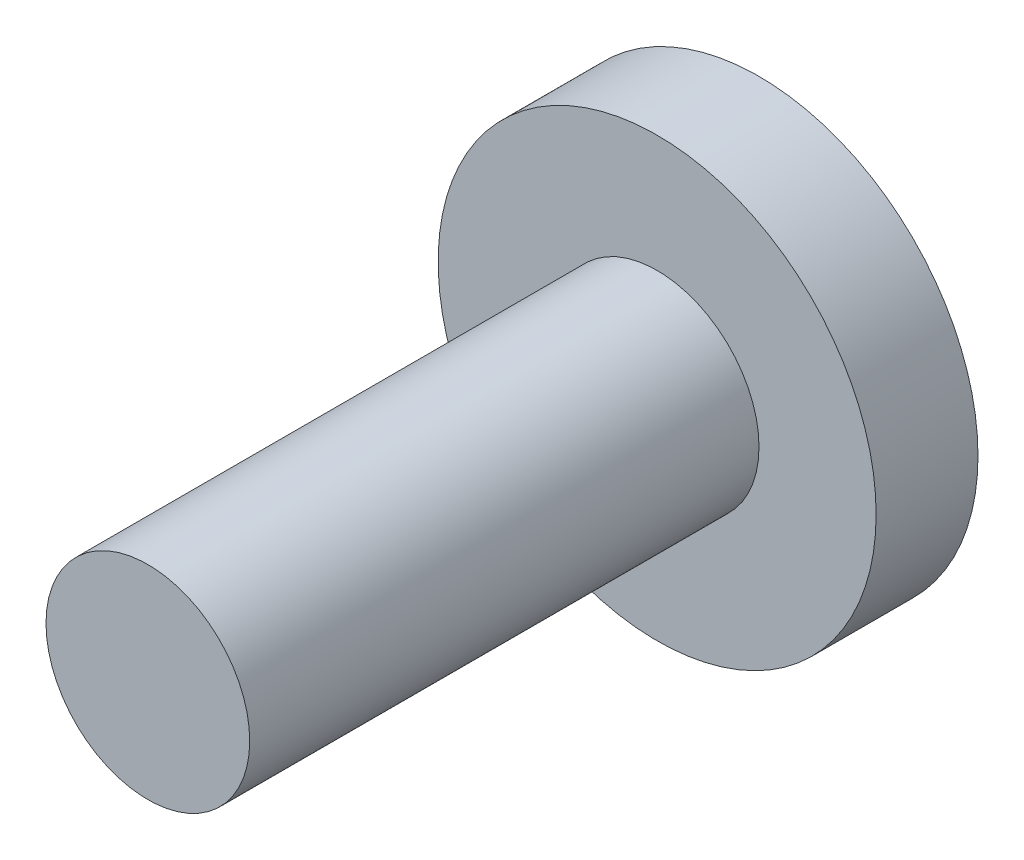
ISO-10303-21;
HEADER;
FILE_DESCRIPTION(('STEP AP214'),'2;1');
FILE_NAME('part.step','',(''),(''),'','','');
FILE_SCHEMA(('AUTOMOTIVE_DESIGN { 1 0 10303 214 1 1 1 1 }'));
ENDSEC;
DATA;
#1=APPLICATION_CONTEXT('core data for automotive mechanical design processes');
#2=APPLICATION_PROTOCOL_DEFINITION('international standard','automotive_design',2000,#1);
#3=PRODUCT_CONTEXT('',#1,'mechanical');
#4=PRODUCT('Part','Part','',(#3));
#5=PRODUCT_RELATED_PRODUCT_CATEGORY('part','',(#4));
#6=PRODUCT_DEFINITION_FORMATION('','',#4);
#7=PRODUCT_DEFINITION_CONTEXT('part definition',#1,'design');
#8=PRODUCT_DEFINITION('design','',#6,#7);
#9=PRODUCT_DEFINITION_SHAPE('','',#8);
#10=(LENGTH_UNIT() NAMED_UNIT(*) SI_UNIT(.MILLI.,.METRE.));
#11=(NAMED_UNIT(*) PLANE_ANGLE_UNIT() SI_UNIT($,.RADIAN.));
#12=(NAMED_UNIT(*) SI_UNIT($,.STERADIAN.) SOLID_ANGLE_UNIT());
#13=UNCERTAINTY_MEASURE_WITH_UNIT(LENGTH_MEASURE(1.E-05),#10,'distance_accuracy_value','');
#14=(GEOMETRIC_REPRESENTATION_CONTEXT(3) GLOBAL_UNCERTAINTY_ASSIGNED_CONTEXT((#13)) GLOBAL_UNIT_ASSIGNED_CONTEXT((#10,
#11,#12)) REPRESENTATION_CONTEXT('',''));
#15=CARTESIAN_POINT('',(0.,0.,0.));
#16=DIRECTION('',(0.,0.,1.));
#17=DIRECTION('',(1.,0.,0.));
#18=AXIS2_PLACEMENT_3D('',#15,#16,#17);
#19=CARTESIAN_POINT('',(33.2,15.9,1.));
#20=DIRECTION('',(0.,0.,-1.));
#21=DIRECTION('',(-1.,0.,0.));
#22=AXIS2_PLACEMENT_3D('',#19,#20,#21);
#23=CYLINDRICAL_SURFACE('',#22,2.14999999999999);
#24=CARTESIAN_POINT('',(33.2,15.9,1.));
#25=DIRECTION('',(0.,0.,1.));
#26=DIRECTION('',(1.,0.,0.));
#27=AXIS2_PLACEMENT_3D('',#24,#25,#26);
#28=CIRCLE('',#27,2.14999999999999);
#29=CARTESIAN_POINT('',(35.35,15.9,1.));
#30=VERTEX_POINT('',#29);
#31=EDGE_CURVE('E10',#30,#30,#28,.T.);
#32=ORIENTED_EDGE('',*,*,#31,.F.);
#33=EDGE_LOOP('',(#32));
#34=FACE_BOUND('',#33,.T.);
#35=CARTESIAN_POINT('',(33.2,15.9,0.));
#36=DIRECTION('',(0.,0.,1.));
#37=DIRECTION('',(1.,0.,0.));
#38=AXIS2_PLACEMENT_3D('',#35,#36,#37);
#39=CIRCLE('',#38,2.14999999999999);
#40=CARTESIAN_POINT('',(35.35,15.9,0.));
#41=VERTEX_POINT('',#40);
#42=EDGE_CURVE('E33',#41,#41,#39,.T.);
#43=ORIENTED_EDGE('',*,*,#42,.T.);
#44=EDGE_LOOP('',(#43));
#45=FACE_BOUND('',#44,.T.);
#46=ADVANCED_FACE('F30',(#34,#45),#23,.T.);
#47=CARTESIAN_POINT('',(33.2,15.9,1.));
#48=DIRECTION('',(0.,0.,1.));
#49=DIRECTION('',(1.,0.,0.));
#50=AXIS2_PLACEMENT_3D('',#47,#48,#49);
#51=PLANE('',#50);
#52=CARTESIAN_POINT('',(33.2,15.9,1.));
#53=DIRECTION('',(0.,0.,1.));
#54=DIRECTION('',(1.,0.,0.));
#55=AXIS2_PLACEMENT_3D('',#52,#53,#54);
#56=CIRCLE('',#55,1.00000000000001);
#57=CARTESIAN_POINT('',(34.2,15.9,1.));
#58=VERTEX_POINT('',#57);
#59=EDGE_CURVE('E40',#58,#58,#56,.F.);
#60=ORIENTED_EDGE('',*,*,#59,.T.);
#61=EDGE_LOOP('',(#60));
#62=FACE_BOUND('',#61,.T.);
#63=ORIENTED_EDGE('',*,*,#31,.T.);
#64=EDGE_LOOP('',(#63));
#65=FACE_BOUND('',#64,.T.);
#66=ADVANCED_FACE('F60',(#62,#65),#51,.T.);
#67=CARTESIAN_POINT('',(33.2,15.9,0.));
#68=DIRECTION('',(0.,0.,1.));
#69=DIRECTION('',(1.,0.,0.));
#70=AXIS2_PLACEMENT_3D('',#67,#68,#69);
#71=PLANE('',#70);
#72=ORIENTED_EDGE('',*,*,#42,.F.);
#73=EDGE_LOOP('',(#72));
#74=FACE_BOUND('',#73,.T.);
#75=ADVANCED_FACE('F52',(#74),#71,.F.);
#76=CARTESIAN_POINT('',(33.2,15.9,6.));
#77=DIRECTION('',(0.,0.,-1.));
#78=DIRECTION('',(-1.,0.,0.));
#79=AXIS2_PLACEMENT_3D('',#76,#77,#78);
#80=CYLINDRICAL_SURFACE('',#79,1.00000000000001);
#81=ORIENTED_EDGE('',*,*,#59,.F.);
#82=EDGE_LOOP('',(#81));
#83=FACE_BOUND('',#82,.T.);
#84=CARTESIAN_POINT('',(33.2,15.9,6.));
#85=DIRECTION('',(0.,0.,1.));
#86=DIRECTION('',(1.,0.,0.));
#87=AXIS2_PLACEMENT_3D('',#84,#85,#86);
#88=CIRCLE('',#87,1.00000000000001);
#89=CARTESIAN_POINT('',(34.2,15.9,6.));
#90=VERTEX_POINT('',#89);
#91=EDGE_CURVE('E44',#90,#90,#88,.T.);
#92=ORIENTED_EDGE('',*,*,#91,.F.);
#93=EDGE_LOOP('',(#92));
#94=FACE_BOUND('',#93,.T.);
#95=ADVANCED_FACE('F50',(#83,#94),#80,.T.);
#96=CARTESIAN_POINT('',(33.2,15.9,6.));
#97=DIRECTION('',(0.,0.,1.));
#98=DIRECTION('',(1.,0.,0.));
#99=AXIS2_PLACEMENT_3D('',#96,#97,#98);
#100=PLANE('',#99);
#101=ORIENTED_EDGE('',*,*,#91,.T.);
#102=EDGE_LOOP('',(#101));
#103=FACE_BOUND('',#102,.T.);
#104=ADVANCED_FACE('F48',(#103),#100,.T.);
#105=CLOSED_SHELL('',(#46,#66,#75,#95,#104));
#106=MANIFOLD_SOLID_BREP('B2',#105);
#107=ADVANCED_BREP_SHAPE_REPRESENTATION('',(#18,#106),#14);
#108=SHAPE_DEFINITION_REPRESENTATION(#9,#107);
ENDSEC;
END-ISO-10303-21;
